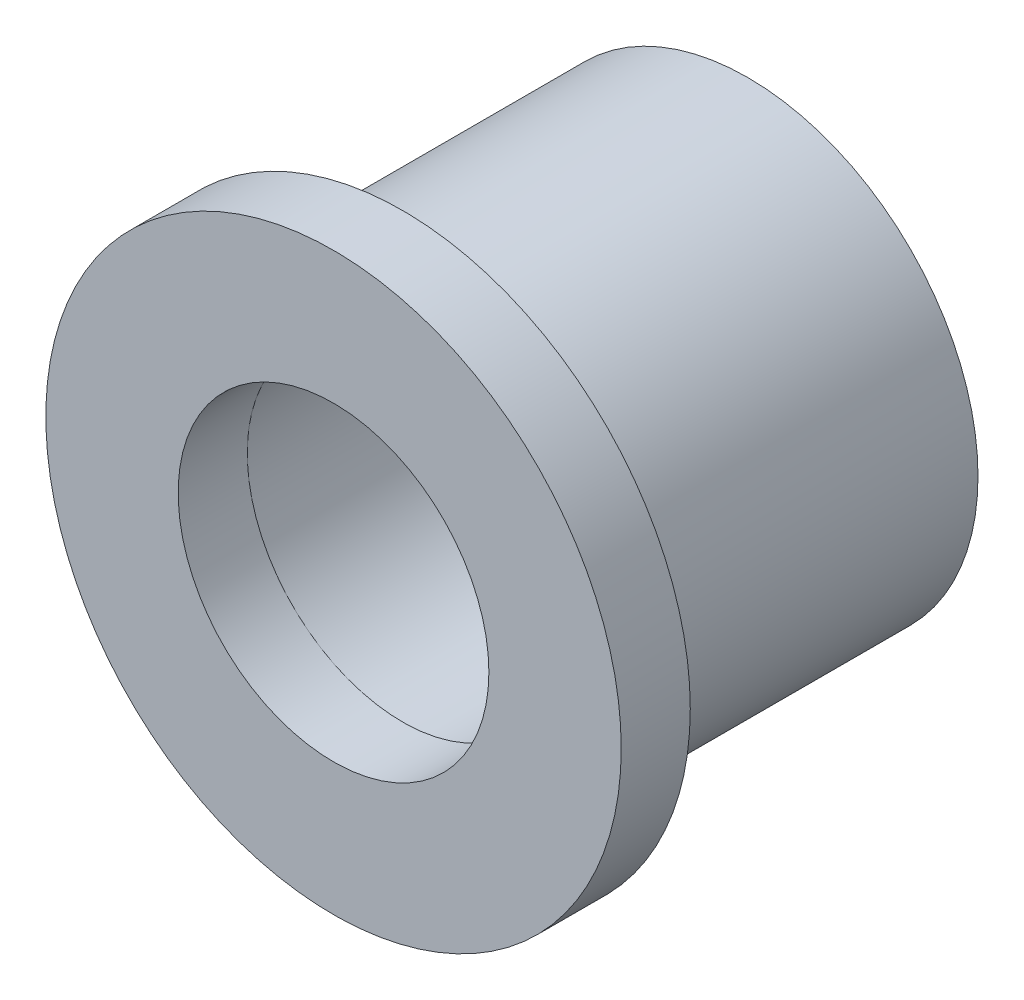
ISO-10303-21;
HEADER;
FILE_DESCRIPTION(('STEP AP214'),'2;1');
FILE_NAME('part.step','',(''),(''),'','','');
FILE_SCHEMA(('AUTOMOTIVE_DESIGN { 1 0 10303 214 1 1 1 1 }'));
ENDSEC;
DATA;
#1=APPLICATION_CONTEXT('core data for automotive mechanical design processes');
#2=APPLICATION_PROTOCOL_DEFINITION('international standard','automotive_design',2000,#1);
#3=PRODUCT_CONTEXT('',#1,'mechanical');
#4=PRODUCT('Part','Part','',(#3));
#5=PRODUCT_RELATED_PRODUCT_CATEGORY('part','',(#4));
#6=PRODUCT_DEFINITION_FORMATION('','',#4);
#7=PRODUCT_DEFINITION_CONTEXT('part definition',#1,'design');
#8=PRODUCT_DEFINITION('design','',#6,#7);
#9=PRODUCT_DEFINITION_SHAPE('','',#8);
#10=(LENGTH_UNIT() NAMED_UNIT(*) SI_UNIT(.MILLI.,.METRE.));
#11=(NAMED_UNIT(*) PLANE_ANGLE_UNIT() SI_UNIT($,.RADIAN.));
#12=(NAMED_UNIT(*) SI_UNIT($,.STERADIAN.) SOLID_ANGLE_UNIT());
#13=UNCERTAINTY_MEASURE_WITH_UNIT(LENGTH_MEASURE(1.E-05),#10,'distance_accuracy_value','');
#14=(GEOMETRIC_REPRESENTATION_CONTEXT(3) GLOBAL_UNCERTAINTY_ASSIGNED_CONTEXT((#13)) GLOBAL_UNIT_ASSIGNED_CONTEXT((#10,
#11,#12)) REPRESENTATION_CONTEXT('',''));
#15=CARTESIAN_POINT('',(0.,0.,0.));
#16=DIRECTION('',(0.,0.,1.));
#17=DIRECTION('',(1.,0.,0.));
#18=AXIS2_PLACEMENT_3D('',#15,#16,#17);
#19=CARTESIAN_POINT('',(0.,0.,0.));
#20=DIRECTION('',(0.,0.,1.));
#21=DIRECTION('',(1.,0.,0.));
#22=AXIS2_PLACEMENT_3D('',#19,#20,#21);
#23=PLANE('',#22);
#24=CARTESIAN_POINT('',(0.,0.,0.));
#25=DIRECTION('',(0.,0.,1.));
#26=DIRECTION('',(1.,0.,0.));
#27=AXIS2_PLACEMENT_3D('',#24,#25,#26);
#28=CIRCLE('',#27,8.5725);
#29=CARTESIAN_POINT('',(8.5725,0.,0.));
#30=VERTEX_POINT('',#29);
#31=EDGE_CURVE('E50',#30,#30,#28,.T.);
#32=ORIENTED_EDGE('',*,*,#31,.T.);
#33=EDGE_LOOP('',(#32));
#34=FACE_BOUND('',#33,.T.);
#35=CARTESIAN_POINT('',(0.,0.,0.));
#36=DIRECTION('',(0.,0.,-1.));
#37=DIRECTION('',(-1.,0.,0.));
#38=AXIS2_PLACEMENT_3D('',#35,#36,#37);
#39=CIRCLE('',#38,8.636);
#40=CARTESIAN_POINT('',(-8.636,0.,0.));
#41=VERTEX_POINT('',#40);
#42=EDGE_CURVE('E59',#41,#41,#39,.T.);
#43=ORIENTED_EDGE('',*,*,#42,.T.);
#44=EDGE_LOOP('',(#43));
#45=FACE_BOUND('',#44,.T.);
#46=ADVANCED_FACE('F32',(#34,#45),#23,.F.);
#47=CARTESIAN_POINT('',(0.,0.,3.81));
#48=DIRECTION('',(0.,0.,1.));
#49=DIRECTION('',(1.,0.,0.));
#50=AXIS2_PLACEMENT_3D('',#47,#48,#49);
#51=PLANE('',#50);
#52=CARTESIAN_POINT('',(0.,0.,3.81));
#53=DIRECTION('',(0.,0.,1.));
#54=DIRECTION('',(1.,0.,0.));
#55=AXIS2_PLACEMENT_3D('',#52,#53,#54);
#56=CIRCLE('',#55,15.875);
#57=CARTESIAN_POINT('',(15.875,0.,3.81));
#58=VERTEX_POINT('',#57);
#59=EDGE_CURVE('E39',#58,#58,#56,.T.);
#60=ORIENTED_EDGE('',*,*,#59,.T.);
#61=EDGE_LOOP('',(#60));
#62=FACE_BOUND('',#61,.T.);
#63=CARTESIAN_POINT('',(0.,0.,3.81));
#64=DIRECTION('',(0.,0.,1.));
#65=DIRECTION('',(1.,0.,0.));
#66=AXIS2_PLACEMENT_3D('',#63,#64,#65);
#67=CIRCLE('',#66,8.5725);
#68=CARTESIAN_POINT('',(8.5725,0.,3.81));
#69=VERTEX_POINT('',#68);
#70=EDGE_CURVE('E48',#69,#69,#67,.T.);
#71=ORIENTED_EDGE('',*,*,#70,.F.);
#72=EDGE_LOOP('',(#71));
#73=FACE_BOUND('',#72,.T.);
#74=ADVANCED_FACE('F84',(#62,#73),#51,.T.);
#75=CARTESIAN_POINT('',(0.,0.,0.));
#76=DIRECTION('',(0.,0.,1.));
#77=DIRECTION('',(1.,0.,0.));
#78=AXIS2_PLACEMENT_3D('',#75,#76,#77);
#79=CIRCLE('',#78,12.7);
#80=CARTESIAN_POINT('',(12.7,0.,0.));
#81=VERTEX_POINT('',#80);
#82=EDGE_CURVE('E10',#81,#81,#79,.F.);
#83=ORIENTED_EDGE('',*,*,#82,.F.);
#84=EDGE_LOOP('',(#83));
#85=FACE_BOUND('',#84,.T.);
#86=CARTESIAN_POINT('',(0.,0.,0.));
#87=DIRECTION('',(0.,0.,1.));
#88=DIRECTION('',(1.,0.,0.));
#89=AXIS2_PLACEMENT_3D('',#86,#87,#88);
#90=CIRCLE('',#89,15.875);
#91=CARTESIAN_POINT('',(15.875,0.,0.));
#92=VERTEX_POINT('',#91);
#93=EDGE_CURVE('E43',#92,#92,#90,.T.);
#94=ORIENTED_EDGE('',*,*,#93,.F.);
#95=EDGE_LOOP('',(#94));
#96=FACE_BOUND('',#95,.T.);
#97=ADVANCED_FACE('F86',(#85,#96),#23,.F.);
#98=CARTESIAN_POINT('',(0.,0.,3.81));
#99=DIRECTION('',(0.,0.,-1.));
#100=DIRECTION('',(-1.,0.,0.));
#101=AXIS2_PLACEMENT_3D('',#98,#99,#100);
#102=CYLINDRICAL_SURFACE('',#101,15.875);
#103=ORIENTED_EDGE('',*,*,#59,.F.);
#104=EDGE_LOOP('',(#103));
#105=FACE_BOUND('',#104,.T.);
#106=ORIENTED_EDGE('',*,*,#93,.T.);
#107=EDGE_LOOP('',(#106));
#108=FACE_BOUND('',#107,.T.);
#109=ADVANCED_FACE('F34',(#105,#108),#102,.T.);
#110=CARTESIAN_POINT('',(0.,0.,3.81));
#111=DIRECTION('',(0.,0.,-1.));
#112=DIRECTION('',(-1.,0.,0.));
#113=AXIS2_PLACEMENT_3D('',#110,#111,#112);
#114=CYLINDRICAL_SURFACE('',#113,8.5725);
#115=ORIENTED_EDGE('',*,*,#70,.T.);
#116=EDGE_LOOP('',(#115));
#117=FACE_BOUND('',#116,.T.);
#118=ORIENTED_EDGE('',*,*,#31,.F.);
#119=EDGE_LOOP('',(#118));
#120=FACE_BOUND('',#119,.T.);
#121=ADVANCED_FACE('F71',(#117,#120),#114,.F.);
#122=CARTESIAN_POINT('',(0.,0.,-19.05));
#123=DIRECTION('',(0.,0.,-1.));
#124=DIRECTION('',(-1.,0.,0.));
#125=AXIS2_PLACEMENT_3D('',#122,#123,#124);
#126=PLANE('',#125);
#127=CARTESIAN_POINT('',(0.,0.,-19.05));
#128=DIRECTION('',(0.,0.,-1.));
#129=DIRECTION('',(-1.,0.,0.));
#130=AXIS2_PLACEMENT_3D('',#127,#128,#129);
#131=CIRCLE('',#130,12.7);
#132=CARTESIAN_POINT('',(-12.7,0.,-19.05));
#133=VERTEX_POINT('',#132);
#134=EDGE_CURVE('E53',#133,#133,#131,.T.);
#135=ORIENTED_EDGE('',*,*,#134,.T.);
#136=EDGE_LOOP('',(#135));
#137=FACE_BOUND('',#136,.T.);
#138=CARTESIAN_POINT('',(0.,0.,-19.05));
#139=DIRECTION('',(0.,0.,-1.));
#140=DIRECTION('',(-1.,0.,0.));
#141=AXIS2_PLACEMENT_3D('',#138,#139,#140);
#142=CIRCLE('',#141,8.636);
#143=CARTESIAN_POINT('',(-8.636,0.,-19.05));
#144=VERTEX_POINT('',#143);
#145=EDGE_CURVE('E58',#144,#144,#142,.T.);
#146=ORIENTED_EDGE('',*,*,#145,.F.);
#147=EDGE_LOOP('',(#146));
#148=FACE_BOUND('',#147,.T.);
#149=ADVANCED_FACE('F68',(#137,#148),#126,.T.);
#150=CARTESIAN_POINT('',(0.,0.,-19.05));
#151=DIRECTION('',(0.,0.,1.));
#152=DIRECTION('',(1.,0.,0.));
#153=AXIS2_PLACEMENT_3D('',#150,#151,#152);
#154=CYLINDRICAL_SURFACE('',#153,12.7);
#155=ORIENTED_EDGE('',*,*,#134,.F.);
#156=EDGE_LOOP('',(#155));
#157=FACE_BOUND('',#156,.T.);
#158=ORIENTED_EDGE('',*,*,#82,.T.);
#159=EDGE_LOOP('',(#158));
#160=FACE_BOUND('',#159,.T.);
#161=ADVANCED_FACE('F70',(#157,#160),#154,.T.);
#162=CARTESIAN_POINT('',(0.,0.,-19.05));
#163=DIRECTION('',(0.,0.,1.));
#164=DIRECTION('',(1.,0.,0.));
#165=AXIS2_PLACEMENT_3D('',#162,#163,#164);
#166=CYLINDRICAL_SURFACE('',#165,8.636);
#167=ORIENTED_EDGE('',*,*,#145,.T.);
#168=EDGE_LOOP('',(#167));
#169=FACE_BOUND('',#168,.T.);
#170=ORIENTED_EDGE('',*,*,#42,.F.);
#171=EDGE_LOOP('',(#170));
#172=FACE_BOUND('',#171,.T.);
#173=ADVANCED_FACE('F65',(#169,#172),#166,.F.);
#174=CLOSED_SHELL('',(#46,#74,#97,#109,#121,#149,#161,#173));
#175=MANIFOLD_SOLID_BREP('B2',#174);
#176=ADVANCED_BREP_SHAPE_REPRESENTATION('',(#18,#175),#14);
#177=SHAPE_DEFINITION_REPRESENTATION(#9,#176);
ENDSEC;
END-ISO-10303-21;
